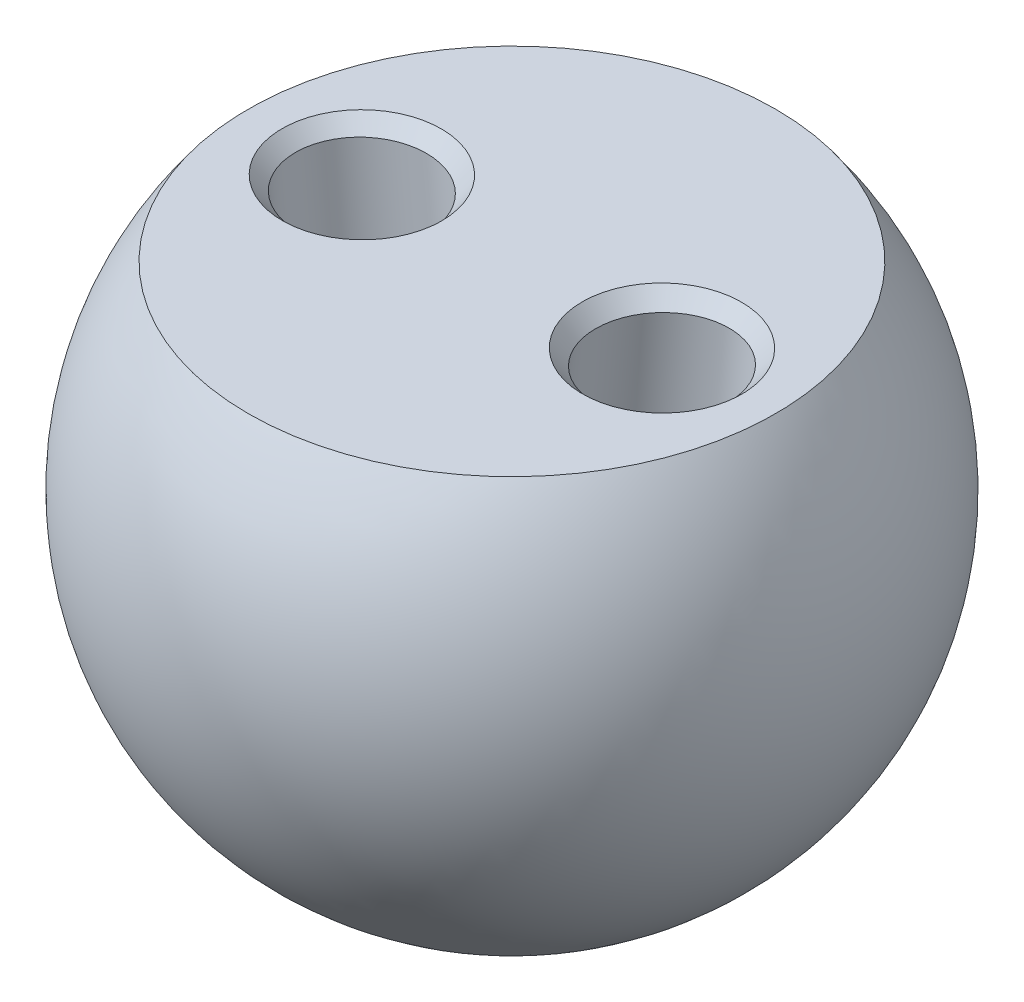
ISO-10303-21;
HEADER;
FILE_DESCRIPTION(('STEP AP214'),'2;1');
FILE_NAME('part.step','',(''),(''),'','','');
FILE_SCHEMA(('AUTOMOTIVE_DESIGN { 1 0 10303 214 1 1 1 1 }'));
ENDSEC;
DATA;
#1=APPLICATION_CONTEXT('core data for automotive mechanical design processes');
#2=APPLICATION_PROTOCOL_DEFINITION('international standard','automotive_design',2000,#1);
#3=PRODUCT_CONTEXT('',#1,'mechanical');
#4=PRODUCT('Part','Part','',(#3));
#5=PRODUCT_RELATED_PRODUCT_CATEGORY('part','',(#4));
#6=PRODUCT_DEFINITION_FORMATION('','',#4);
#7=PRODUCT_DEFINITION_CONTEXT('part definition',#1,'design');
#8=PRODUCT_DEFINITION('design','',#6,#7);
#9=PRODUCT_DEFINITION_SHAPE('','',#8);
#10=(LENGTH_UNIT() NAMED_UNIT(*) SI_UNIT(.MILLI.,.METRE.));
#11=(NAMED_UNIT(*) PLANE_ANGLE_UNIT() SI_UNIT($,.RADIAN.));
#12=(NAMED_UNIT(*) SI_UNIT($,.STERADIAN.) SOLID_ANGLE_UNIT());
#13=UNCERTAINTY_MEASURE_WITH_UNIT(LENGTH_MEASURE(1.E-05),#10,'distance_accuracy_value','');
#14=(GEOMETRIC_REPRESENTATION_CONTEXT(3) GLOBAL_UNCERTAINTY_ASSIGNED_CONTEXT((#13)) GLOBAL_UNIT_ASSIGNED_CONTEXT((#10,
#11,#12)) REPRESENTATION_CONTEXT('',''));
#15=CARTESIAN_POINT('',(0.,0.,0.));
#16=DIRECTION('',(0.,0.,1.));
#17=DIRECTION('',(1.,0.,0.));
#18=AXIS2_PLACEMENT_3D('',#15,#16,#17);
#19=CARTESIAN_POINT('',(0.,0.,0.));
#20=DIRECTION('',(0.,-1.,0.));
#21=DIRECTION('',(0.,0.,1.));
#22=AXIS2_PLACEMENT_3D('',#19,#20,#21);
#23=SPHERICAL_SURFACE('',#22,20.);
#24=CARTESIAN_POINT('',(0.,12.,0.));
#25=DIRECTION('',(0.,-1.,0.));
#26=DIRECTION('',(0.,0.,-1.));
#27=AXIS2_PLACEMENT_3D('',#24,#25,#26);
#28=CIRCLE('',#27,16.);
#29=CARTESIAN_POINT('',(0.,12.,-16.));
#30=VERTEX_POINT('',#29);
#31=EDGE_CURVE('E133',#30,#30,#28,.T.);
#32=ORIENTED_EDGE('',*,*,#31,.T.);
#33=EDGE_LOOP('',(#32));
#34=FACE_BOUND('',#33,.T.);
#35=ADVANCED_FACE('F37',(#34),#23,.T.);
#36=CARTESIAN_POINT('',(0.,12.,0.));
#37=DIRECTION('',(0.,1.,0.));
#38=DIRECTION('',(0.,0.,1.));
#39=AXIS2_PLACEMENT_3D('',#36,#37,#38);
#40=PLANE('',#39);
#41=CARTESIAN_POINT('',(-4.25758189983628,12.,0.));
#42=CARTESIAN_POINT('',(-4.25758189983628,12.,-0.315753843605591));
#43=CARTESIAN_POINT('',(-4.28882348174933,12.,-0.631494616984648));
#44=CARTESIAN_POINT('',(-4.41259433626494,12.,-1.25086806106186));
#45=CARTESIAN_POINT('',(-4.50511848553221,12.,-1.55447509359125));
#46=CARTESIAN_POINT('',(-4.74790375003477,12.,-2.13791212042559));
#47=CARTESIAN_POINT('',(-4.89815481548956,12.,-2.41771796411122));
#48=CARTESIAN_POINT('',(-5.25062438841793,12.,-2.94279741595592));
#49=CARTESIAN_POINT('',(-5.45282830587845,12.,-3.18804928914202));
#50=CARTESIAN_POINT('',(-5.90143697921028,12.,-3.63459265713107));
#51=CARTESIAN_POINT('',(-6.14782316552747,12.,-3.83586566786904));
#52=CARTESIAN_POINT('',(-6.67533115952786,12.,-4.18671254079643));
#53=CARTESIAN_POINT('',(-6.95643113173738,12.,-4.33627188015713));
#54=CARTESIAN_POINT('',(-7.54256661002643,12.,-4.57793940945538));
#55=CARTESIAN_POINT('',(-7.84757785383874,12.,-4.67003759589915));
#56=CARTESIAN_POINT('',(-8.46981595869514,12.,-4.79323863394788));
#57=CARTESIAN_POINT('',(-8.78701706306162,12.,-4.82433638581749));
#58=CARTESIAN_POINT('',(-9.42144553307251,12.,-4.8243363858175));
#59=CARTESIAN_POINT('',(-9.73864663743898,12.,-4.79323863394788));
#60=CARTESIAN_POINT('',(-10.3608847422954,12.,-4.67003759589916));
#61=CARTESIAN_POINT('',(-10.6658959861077,12.,-4.57793940945539));
#62=CARTESIAN_POINT('',(-11.2520314643967,12.,-4.33627188015713));
#63=CARTESIAN_POINT('',(-11.5331314366063,12.,-4.18671254079643));
#64=CARTESIAN_POINT('',(-12.0606394306066,12.,-3.83586566786904));
#65=CARTESIAN_POINT('',(-12.3070256169238,12.,-3.63459265713108));
#66=CARTESIAN_POINT('',(-12.7556342902557,12.,-3.18804928914203));
#67=CARTESIAN_POINT('',(-12.9578382077162,12.,-2.94279741595593));
#68=CARTESIAN_POINT('',(-13.3103077806446,12.,-2.41771796411122));
#69=CARTESIAN_POINT('',(-13.4605588460993,12.,-2.13791212042561));
#70=CARTESIAN_POINT('',(-13.7033441106019,12.,-1.55447509359127));
#71=CARTESIAN_POINT('',(-13.7958682598692,12.,-1.25086806106188));
#72=CARTESIAN_POINT('',(-13.9196391143848,12.,-0.631494616984648));
#73=CARTESIAN_POINT('',(-13.9508806962978,12.,-0.315753843605586));
#74=CARTESIAN_POINT('',(-13.9508806962978,12.,0.315753843605606));
#75=CARTESIAN_POINT('',(-13.9196391143848,12.,0.63149461698465));
#76=CARTESIAN_POINT('',(-13.7958682598692,12.,1.25086806106186));
#77=CARTESIAN_POINT('',(-13.7033441106019,12.,1.55447509359126));
#78=CARTESIAN_POINT('',(-13.4605588460993,12.,2.13791212042559));
#79=CARTESIAN_POINT('',(-13.3103077806446,12.,2.41771796411121));
#80=CARTESIAN_POINT('',(-12.9578382077162,12.,2.94279741595592));
#81=CARTESIAN_POINT('',(-12.7556342902557,12.,3.18804928914203));
#82=CARTESIAN_POINT('',(-12.3070256169238,12.,3.63459265713108));
#83=CARTESIAN_POINT('',(-12.0606394306067,12.,3.83586566786904));
#84=CARTESIAN_POINT('',(-11.5331314366063,12.,4.18671254079642));
#85=CARTESIAN_POINT('',(-11.2520314643967,12.,4.33627188015713));
#86=CARTESIAN_POINT('',(-10.6658959861077,12.,4.57793940945538));
#87=CARTESIAN_POINT('',(-10.3608847422954,12.,4.67003759589916));
#88=CARTESIAN_POINT('',(-9.73864663743899,12.,4.79323863394788));
#89=CARTESIAN_POINT('',(-9.4214455330725,12.,4.82433638581749));
#90=CARTESIAN_POINT('',(-8.78701706306162,12.,4.8243363858175));
#91=CARTESIAN_POINT('',(-8.46981595869514,12.,4.79323863394788));
#92=CARTESIAN_POINT('',(-7.84757785383875,12.,4.67003759589916));
#93=CARTESIAN_POINT('',(-7.54256661002643,12.,4.57793940945538));
#94=CARTESIAN_POINT('',(-6.95643113173738,12.,4.33627188015713));
#95=CARTESIAN_POINT('',(-6.67533115952787,12.,4.18671254079643));
#96=CARTESIAN_POINT('',(-6.14782316552747,12.,3.83586566786904));
#97=CARTESIAN_POINT('',(-5.90143697921028,12.,3.63459265713107));
#98=CARTESIAN_POINT('',(-5.45282830587846,12.,3.18804928914203));
#99=CARTESIAN_POINT('',(-5.25062438841793,12.,2.94279741595592));
#100=CARTESIAN_POINT('',(-4.89815481548956,12.,2.41771796411122));
#101=CARTESIAN_POINT('',(-4.74790375003477,12.,2.13791212042559));
#102=CARTESIAN_POINT('',(-4.50511848553222,12.,1.55447509359127));
#103=CARTESIAN_POINT('',(-4.41259433626494,12.,1.25086806106187));
#104=CARTESIAN_POINT('',(-4.28882348174933,12.,0.631494616984654));
#105=CARTESIAN_POINT('',(-4.25758189983628,12.,0.31575384360559));
#106=CARTESIAN_POINT('',(-4.25758189983628,12.,0.));
#107=B_SPLINE_CURVE_WITH_KNOTS('',3,(#41,#42,#43,#44,#45,#46,#47,#48,#49,#50,#51,#52,#53,#54,
#55,#56,#57,#58,#59,#60,#61,#62,#63,#64,#65,#66,#67,#68,#69,#70,#71,#72,#73,#74,#75,#76,#77,#78,
#79,#80,#81,#82,#83,#84,#85,#86,#87,#88,#89,#90,#91,#92,#93,#94,#95,#96,#97,#98,#99,#100,#101,
#102,#103,#104,#105,#106),.UNSPECIFIED.,.T.,.F.,(4,2,2,2,2,2,2,2,2,2,2,2,2,2,2,2,2,2,2,2,2,2,2,
2,2,2,2,2,2,2,2,2,4),(-6.28318530717959,-6.08683576633022,-5.89048622548086,-5.6941366846315,
-5.49778714378214,-5.30143760293278,-5.10508806208341,-4.90873852123405,-4.71238898038469,
-4.51603943953533,-4.31968989868597,-4.1233403578366,-3.92699081698724,-3.73064127613788,
-3.53429173528852,-3.33794219443916,-3.14159265358979,-2.94524311274043,-2.74889357189107,
-2.55254403104171,-2.35619449019234,-2.15984494934298,-1.96349540849362,-1.76714586764426,
-1.5707963267949,-1.37444678594553,-1.17809724509617,-0.98174770424681,-0.785398163397448,
-0.589048622548086,-0.392699081698724,-0.196349540849362,0.),.UNSPECIFIED.);
#108=CARTESIAN_POINT('',(-4.25758189983628,12.,0.));
#109=VERTEX_POINT('',#108);
#110=EDGE_CURVE('E55',#109,#109,#107,.F.);
#111=ORIENTED_EDGE('',*,*,#110,.T.);
#112=EDGE_LOOP('',(#111));
#113=FACE_BOUND('',#112,.T.);
#114=CARTESIAN_POINT('',(4.25758189983626,12.,0.));
#115=CARTESIAN_POINT('',(4.25758189983626,12.,0.315753843605592));
#116=CARTESIAN_POINT('',(4.28882348174932,12.,0.63149461698465));
#117=CARTESIAN_POINT('',(4.41259433626492,12.,1.25086806106187));
#118=CARTESIAN_POINT('',(4.5051184855322,12.,1.55447509359126));
#119=CARTESIAN_POINT('',(4.74790375003476,12.,2.1379121204256));
#120=CARTESIAN_POINT('',(4.89815481548955,12.,2.41771796411122));
#121=CARTESIAN_POINT('',(5.25062438841792,12.,2.94279741595593));
#122=CARTESIAN_POINT('',(5.45282830587844,12.,3.18804928914202));
#123=CARTESIAN_POINT('',(5.90143697921027,12.,3.63459265713108));
#124=CARTESIAN_POINT('',(6.14782316552746,12.,3.83586566786905));
#125=CARTESIAN_POINT('',(6.67533115952786,12.,4.18671254079644));
#126=CARTESIAN_POINT('',(6.95643113173737,12.,4.33627188015714));
#127=CARTESIAN_POINT('',(7.54256661002642,12.,4.5779394094554));
#128=CARTESIAN_POINT('',(7.84757785383873,12.,4.67003759589917));
#129=CARTESIAN_POINT('',(8.46981595869513,12.,4.79323863394789));
#130=CARTESIAN_POINT('',(8.78701706306162,12.,4.82433638581751));
#131=CARTESIAN_POINT('',(9.42144553307251,12.,4.82433638581751));
#132=CARTESIAN_POINT('',(9.73864663743898,12.,4.79323863394789));
#133=CARTESIAN_POINT('',(10.3608847422954,12.,4.67003759589917));
#134=CARTESIAN_POINT('',(10.6658959861077,12.,4.5779394094554));
#135=CARTESIAN_POINT('',(11.2520314643967,12.,4.33627188015714));
#136=CARTESIAN_POINT('',(11.5331314366063,12.,4.18671254079644));
#137=CARTESIAN_POINT('',(12.0606394306067,12.,3.83586566786905));
#138=CARTESIAN_POINT('',(12.3070256169238,12.,3.63459265713109));
#139=CARTESIAN_POINT('',(12.7556342902557,12.,3.18804928914204));
#140=CARTESIAN_POINT('',(12.9578382077162,12.,2.94279741595594));
#141=CARTESIAN_POINT('',(13.3103077806446,12.,2.41771796411122));
#142=CARTESIAN_POINT('',(13.4605588460993,12.,2.13791212042561));
#143=CARTESIAN_POINT('',(13.7033441106019,12.,1.55447509359127));
#144=CARTESIAN_POINT('',(13.7958682598692,12.,1.25086806106188));
#145=CARTESIAN_POINT('',(13.9196391143848,12.,0.631494616984649));
#146=CARTESIAN_POINT('',(13.9508806962979,12.,0.315753843605586));
#147=CARTESIAN_POINT('',(13.9508806962979,12.,-0.315753843605607));
#148=CARTESIAN_POINT('',(13.9196391143848,12.,-0.631494616984651));
#149=CARTESIAN_POINT('',(13.7958682598692,12.,-1.25086806106186));
#150=CARTESIAN_POINT('',(13.7033441106019,12.,-1.55447509359126));
#151=CARTESIAN_POINT('',(13.4605588460994,12.,-2.1379121204256));
#152=CARTESIAN_POINT('',(13.3103077806446,12.,-2.41771796411122));
#153=CARTESIAN_POINT('',(12.9578382077162,12.,-2.94279741595593));
#154=CARTESIAN_POINT('',(12.7556342902557,12.,-3.18804928914204));
#155=CARTESIAN_POINT('',(12.3070256169238,12.,-3.63459265713109));
#156=CARTESIAN_POINT('',(12.0606394306067,12.,-3.83586566786905));
#157=CARTESIAN_POINT('',(11.5331314366063,12.,-4.18671254079643));
#158=CARTESIAN_POINT('',(11.2520314643968,12.,-4.33627188015714));
#159=CARTESIAN_POINT('',(10.6658959861077,12.,-4.5779394094554));
#160=CARTESIAN_POINT('',(10.3608847422954,12.,-4.67003759589917));
#161=CARTESIAN_POINT('',(9.73864663743898,12.,-4.79323863394789));
#162=CARTESIAN_POINT('',(9.4214455330725,12.,-4.82433638581751));
#163=CARTESIAN_POINT('',(8.78701706306161,12.,-4.82433638581751));
#164=CARTESIAN_POINT('',(8.46981595869514,12.,-4.79323863394789));
#165=CARTESIAN_POINT('',(7.84757785383875,12.,-4.67003759589917));
#166=CARTESIAN_POINT('',(7.54256661002642,12.,-4.5779394094554));
#167=CARTESIAN_POINT('',(6.95643113173737,12.,-4.33627188015714));
#168=CARTESIAN_POINT('',(6.67533115952786,12.,-4.18671254079644));
#169=CARTESIAN_POINT('',(6.14782316552746,12.,-3.83586566786905));
#170=CARTESIAN_POINT('',(5.90143697921027,12.,-3.63459265713108));
#171=CARTESIAN_POINT('',(5.45282830587845,12.,-3.18804928914204));
#172=CARTESIAN_POINT('',(5.25062438841792,12.,-2.94279741595593));
#173=CARTESIAN_POINT('',(4.89815481548955,12.,-2.41771796411123));
#174=CARTESIAN_POINT('',(4.74790375003476,12.,-2.1379121204256));
#175=CARTESIAN_POINT('',(4.5051184855322,12.,-1.55447509359127));
#176=CARTESIAN_POINT('',(4.41259433626492,12.,-1.25086806106187));
#177=CARTESIAN_POINT('',(4.28882348174932,12.,-0.631494616984656));
#178=CARTESIAN_POINT('',(4.25758189983626,12.,-0.315753843605591));
#179=CARTESIAN_POINT('',(4.25758189983626,12.,0.));
#180=B_SPLINE_CURVE_WITH_KNOTS('',3,(#114,#115,#116,#117,#118,#119,#120,#121,#122,#123,#124,
#125,#126,#127,#128,#129,#130,#131,#132,#133,#134,#135,#136,#137,#138,#139,#140,#141,#142,#143,
#144,#145,#146,#147,#148,#149,#150,#151,#152,#153,#154,#155,#156,#157,#158,#159,#160,#161,#162,
#163,#164,#165,#166,#167,#168,#169,#170,#171,#172,#173,#174,#175,#176,#177,#178,#179),
.UNSPECIFIED.,.T.,.F.,(4,2,2,2,2,2,2,2,2,2,2,2,2,2,2,2,2,2,2,2,2,2,2,2,2,2,2,2,2,2,2,2,4),
(-6.28318530717959,-6.08683576633022,-5.89048622548086,-5.6941366846315,-5.49778714378214,
-5.30143760293278,-5.10508806208341,-4.90873852123405,-4.71238898038469,-4.51603943953533,
-4.31968989868597,-4.1233403578366,-3.92699081698724,-3.73064127613788,-3.53429173528852,
-3.33794219443916,-3.14159265358979,-2.94524311274043,-2.74889357189107,-2.55254403104171,
-2.35619449019234,-2.15984494934298,-1.96349540849362,-1.76714586764426,-1.5707963267949,
-1.37444678594553,-1.17809724509617,-0.98174770424681,-0.785398163397448,-0.589048622548086,
-0.392699081698724,-0.196349540849362,0.),.UNSPECIFIED.);
#181=CARTESIAN_POINT('',(4.25758189983626,12.,0.));
#182=VERTEX_POINT('',#181);
#183=EDGE_CURVE('E60',#182,#182,#180,.F.);
#184=ORIENTED_EDGE('',*,*,#183,.T.);
#185=EDGE_LOOP('',(#184));
#186=FACE_BOUND('',#185,.T.);
#187=ORIENTED_EDGE('',*,*,#31,.F.);
#188=EDGE_LOOP('',(#187));
#189=FACE_BOUND('',#188,.T.);
#190=ADVANCED_FACE('F83',(#113,#186,#189),#40,.T.);
#191=CARTESIAN_POINT('',(9.29175172472006,13.0310870342896,0.));
#192=DIRECTION('',(-0.0958457525202242,-0.995396198367179,0.));
#193=DIRECTION('',(0.995396198367179,-0.0958457525202242,0.));
#194=AXIS2_PLACEMENT_3D('',#191,#192,#193);
#195=CYLINDRICAL_SURFACE('',#194,4.);
#196=CARTESIAN_POINT('',(5.07812320445475,11.0046038016328,0.));
#197=CARTESIAN_POINT('',(5.07812320445475,11.0046038016328,-0.261800851646131));
#198=CARTESIAN_POINT('',(5.104075563592,11.0051130958595,-0.523590866373562));
#199=CARTESIAN_POINT('',(5.20689192148759,11.0071307843946,-1.03713170975547));
#200=CARTESIAN_POINT('',(5.28375166429261,11.0086390951833,-1.28886128103266));
#201=CARTESIAN_POINT('',(5.48543320510861,11.0125969336146,-1.77260617788805));
#202=CARTESIAN_POINT('',(5.61024665477064,11.0150462974276,-2.00460147946387));
#203=CARTESIAN_POINT('',(5.90304286999555,11.0207921882437,-2.43996038469295));
#204=CARTESIAN_POINT('',(6.07101351564255,11.0240884774033,-2.64330596723248));
#205=CARTESIAN_POINT('',(6.44367241092495,11.0314016092425,-3.0135482822599));
#206=CARTESIAN_POINT('',(6.64834523484573,11.0354181492049,-3.18042968906256));
#207=CARTESIAN_POINT('',(7.08654573782779,11.0440174825117,-3.4713272093578));
#208=CARTESIAN_POINT('',(7.32005527818196,11.0485999198987,-3.59533128154631));
#209=CARTESIAN_POINT('',(7.8069575892793,11.0581549871168,-3.79570497854398));
#210=CARTESIAN_POINT('',(8.06033020538447,11.0631272214294,-3.87206630916417));
#211=CARTESIAN_POINT('',(8.57722294184052,11.0732708266842,-3.97421593406167));
#212=CARTESIAN_POINT('',(8.8407216661513,11.0784417777462,-4.));
#213=CARTESIAN_POINT('',(9.3677409299828,11.0887841079763,-4.));
#214=CARTESIAN_POINT('',(9.6312396542936,11.0939550590384,-3.97421593406167));
#215=CARTESIAN_POINT('',(10.1481323907497,11.1040986642931,-3.87206630916417));
#216=CARTESIAN_POINT('',(10.4015050068548,11.1090708986057,-3.79570497854398));
#217=CARTESIAN_POINT('',(10.8884073179522,11.1186259658239,-3.59533128154631));
#218=CARTESIAN_POINT('',(11.1219168583063,11.1232084032108,-3.4713272093578));
#219=CARTESIAN_POINT('',(11.5601173612884,11.1318077365177,-3.18042968906256));
#220=CARTESIAN_POINT('',(11.7647901852092,11.1358242764801,-3.0135482822599));
#221=CARTESIAN_POINT('',(12.1374490804916,11.1431374083193,-2.64330596723248));
#222=CARTESIAN_POINT('',(12.3054197261386,11.1464336974788,-2.43996038469296));
#223=CARTESIAN_POINT('',(12.5982159413635,11.1521795882949,-2.00460147946386));
#224=CARTESIAN_POINT('',(12.7230293910255,11.1546289521079,-1.77260617788805));
#225=CARTESIAN_POINT('',(12.9247109318415,11.1585867905392,-1.28886128103266));
#226=CARTESIAN_POINT('',(13.0015706746465,11.1600951013279,-1.03713170975546));
#227=CARTESIAN_POINT('',(13.1043870325421,11.162112789863,-0.52359086637356));
#228=CARTESIAN_POINT('',(13.1303393916794,11.1626220840898,-0.261800851646146));
#229=CARTESIAN_POINT('',(13.1303393916794,11.1626220840898,0.26180085164613));
#230=CARTESIAN_POINT('',(13.1043870325421,11.162112789863,0.523590866373558));
#231=CARTESIAN_POINT('',(13.0015706746465,11.1600951013279,1.03713170975547));
#232=CARTESIAN_POINT('',(12.9247109318415,11.1585867905392,1.28886128103267));
#233=CARTESIAN_POINT('',(12.7230293910255,11.1546289521079,1.77260617788806));
#234=CARTESIAN_POINT('',(12.5982159413635,11.1521795882949,2.00460147946387));
#235=CARTESIAN_POINT('',(12.3054197261386,11.1464336974788,2.43996038469296));
#236=CARTESIAN_POINT('',(12.1374490804916,11.1431374083193,2.64330596723248));
#237=CARTESIAN_POINT('',(11.7647901852091,11.1358242764801,3.01354828225991));
#238=CARTESIAN_POINT('',(11.5601173612884,11.1318077365177,3.18042968906256));
#239=CARTESIAN_POINT('',(11.1219168583063,11.1232084032108,3.4713272093578));
#240=CARTESIAN_POINT('',(10.8884073179522,11.1186259658239,3.59533128154632));
#241=CARTESIAN_POINT('',(10.4015050068548,11.1090708986057,3.79570497854398));
#242=CARTESIAN_POINT('',(10.1481323907496,11.1040986642931,3.87206630916417));
#243=CARTESIAN_POINT('',(9.6312396542936,11.0939550590384,3.97421593406167));
#244=CARTESIAN_POINT('',(9.36774092998282,11.0887841079763,4.));
#245=CARTESIAN_POINT('',(8.84072166615131,11.0784417777462,4.));
#246=CARTESIAN_POINT('',(8.57722294184052,11.0732708266842,3.97421593406167));
#247=CARTESIAN_POINT('',(8.06033020538446,11.0631272214294,3.87206630916417));
#248=CARTESIAN_POINT('',(7.8069575892793,11.0581549871168,3.79570497854398));
#249=CARTESIAN_POINT('',(7.32005527818195,11.0485999198987,3.59533128154631));
#250=CARTESIAN_POINT('',(7.08654573782779,11.0440174825117,3.4713272093578));
#251=CARTESIAN_POINT('',(6.64834523484573,11.0354181492049,3.18042968906256));
#252=CARTESIAN_POINT('',(6.44367241092496,11.0314016092425,3.0135482822599));
#253=CARTESIAN_POINT('',(6.07101351564253,11.0240884774033,2.64330596723247));
#254=CARTESIAN_POINT('',(5.90304286999555,11.0207921882437,2.43996038469295));
#255=CARTESIAN_POINT('',(5.61024665477064,11.0150462974276,2.00460147946387));
#256=CARTESIAN_POINT('',(5.48543320510861,11.0125969336146,1.77260617788805));
#257=CARTESIAN_POINT('',(5.28375166429261,11.0086390951833,1.28886128103265));
#258=CARTESIAN_POINT('',(5.2068919214876,11.0071307843946,1.03713170975546));
#259=CARTESIAN_POINT('',(5.10407556359199,11.0051130958595,0.523590866373559));
#260=CARTESIAN_POINT('',(5.07812320445475,11.0046038016328,0.261800851646132));
#261=CARTESIAN_POINT('',(5.07812320445475,11.0046038016328,0.));
#262=B_SPLINE_CURVE_WITH_KNOTS('',3,(#196,#197,#198,#199,#200,#201,#202,#203,#204,#205,#206,
#207,#208,#209,#210,#211,#212,#213,#214,#215,#216,#217,#218,#219,#220,#221,#222,#223,#224,#225,
#226,#227,#228,#229,#230,#231,#232,#233,#234,#235,#236,#237,#238,#239,#240,#241,#242,#243,#244,
#245,#246,#247,#248,#249,#250,#251,#252,#253,#254,#255,#256,#257,#258,#259,#260,#261),
.UNSPECIFIED.,.T.,.F.,(4,2,2,2,2,2,2,2,2,2,2,2,2,2,2,2,2,2,2,2,2,2,2,2,2,2,2,2,2,2,2,2,4),
(-6.28318530717959,-6.08683576633022,-5.89048622548086,-5.6941366846315,-5.49778714378214,
-5.30143760293278,-5.10508806208341,-4.90873852123405,-4.71238898038469,-4.51603943953533,
-4.31968989868597,-4.1233403578366,-3.92699081698724,-3.73064127613788,-3.53429173528852,
-3.33794219443916,-3.14159265358979,-2.94524311274043,-2.74889357189107,-2.55254403104171,
-2.35619449019234,-2.15984494934298,-1.96349540849362,-1.76714586764426,-1.5707963267949,
-1.37444678594553,-1.17809724509617,-0.981747704246811,-0.785398163397448,-0.589048622548086,
-0.392699081698725,-0.196349540849362,0.),.UNSPECIFIED.);
#263=CARTESIAN_POINT('',(5.07812320445475,11.0046038016328,0.));
#264=VERTEX_POINT('',#263);
#265=EDGE_CURVE('E10',#264,#264,#262,.F.);
#266=ORIENTED_EDGE('',*,*,#265,.T.);
#267=EDGE_LOOP('',(#266));
#268=FACE_BOUND('',#267,.T.);
#269=CARTESIAN_POINT('',(7.9631695869392,-0.766766020143368,0.));
#270=DIRECTION('',(0.0958457525202243,0.995396198367179,0.));
#271=DIRECTION('',(-0.995396198367179,0.0958457525202243,0.));
#272=AXIS2_PLACEMENT_3D('',#269,#270,#271);
#273=CIRCLE('',#272,4.);
#274=CARTESIAN_POINT('',(3.98158479347049,-0.383383010062471,0.));
#275=VERTEX_POINT('',#274);
#276=EDGE_CURVE('E75',#275,#275,#273,.F.);
#277=ORIENTED_EDGE('',*,*,#276,.T.);
#278=EDGE_LOOP('',(#277));
#279=FACE_BOUND('',#278,.T.);
#280=ADVANCED_FACE('F93',(#268,#279),#195,.F.);
#281=CARTESIAN_POINT('',(7.00471206173519,-10.7207280038336,0.));
#282=DIRECTION('',(0.0958457525202242,0.995396198367179,0.));
#283=DIRECTION('',(-0.995396198367179,0.0958457525202242,0.));
#284=AXIS2_PLACEMENT_3D('',#281,#282,#283);
#285=PLANE('',#284);
#286=CARTESIAN_POINT('',(7.00471206173519,-10.7207280038336,0.));
#287=DIRECTION('',(0.0958457525202242,0.995396198367179,0.));
#288=DIRECTION('',(-0.995396198367179,0.0958457525202242,0.));
#289=AXIS2_PLACEMENT_3D('',#286,#287,#288);
#290=CIRCLE('',#289,3.82544935071748);
#291=CARTESIAN_POINT('',(3.19687432098481,-10.3540749320861,0.));
#292=VERTEX_POINT('',#291);
#293=EDGE_CURVE('E135',#292,#292,#290,.T.);
#294=ORIENTED_EDGE('',*,*,#293,.T.);
#295=EDGE_LOOP('',(#294));
#296=FACE_BOUND('',#295,.T.);
#297=ADVANCED_FACE('F120',(#296),#285,.T.);
#298=CARTESIAN_POINT('',(-9.29175172472006,13.0310870342896,0.));
#299=DIRECTION('',(0.0958457525202242,-0.995396198367179,0.));
#300=DIRECTION('',(0.995396198367179,0.0958457525202242,0.));
#301=AXIS2_PLACEMENT_3D('',#298,#299,#300);
#302=CYLINDRICAL_SURFACE('',#301,4.);
#303=CARTESIAN_POINT('',(-5.07812320445475,11.0046038016328,0.));
#304=CARTESIAN_POINT('',(-5.07812320445475,11.0046038016328,0.261800851646133));
#305=CARTESIAN_POINT('',(-5.104075563592,11.0051130958595,0.523590866373563));
#306=CARTESIAN_POINT('',(-5.2068919214876,11.0071307843947,1.03713170975547));
#307=CARTESIAN_POINT('',(-5.28375166429261,11.0086390951834,1.28886128103266));
#308=CARTESIAN_POINT('',(-5.48543320510861,11.0125969336147,1.77260617788805));
#309=CARTESIAN_POINT('',(-5.61024665477064,11.0150462974276,2.00460147946387));
#310=CARTESIAN_POINT('',(-5.90304286999555,11.0207921882438,2.43996038469295));
#311=CARTESIAN_POINT('',(-6.07101351564255,11.0240884774033,2.64330596723248));
#312=CARTESIAN_POINT('',(-6.44367241092495,11.0314016092425,3.01354828225989));
#313=CARTESIAN_POINT('',(-6.64834523484573,11.0354181492049,3.18042968906256));
#314=CARTESIAN_POINT('',(-7.0865457378278,11.0440174825117,3.47132720935781));
#315=CARTESIAN_POINT('',(-7.32005527818196,11.0485999198987,3.59533128154631));
#316=CARTESIAN_POINT('',(-7.80695758927931,11.0581549871168,3.79570497854398));
#317=CARTESIAN_POINT('',(-8.06033020538447,11.0631272214294,3.87206630916417));
#318=CARTESIAN_POINT('',(-8.57722294184053,11.0732708266842,3.97421593406167));
#319=CARTESIAN_POINT('',(-8.8407216661513,11.0784417777462,4.));
#320=CARTESIAN_POINT('',(-9.36774092998281,11.0887841079763,4.));
#321=CARTESIAN_POINT('',(-9.6312396542936,11.0939550590384,3.97421593406167));
#322=CARTESIAN_POINT('',(-10.1481323907497,11.1040986642932,3.87206630916417));
#323=CARTESIAN_POINT('',(-10.4015050068548,11.1090708986058,3.79570497854398));
#324=CARTESIAN_POINT('',(-10.8884073179522,11.1186259658239,3.59533128154631));
#325=CARTESIAN_POINT('',(-11.1219168583063,11.1232084032108,3.4713272093578));
#326=CARTESIAN_POINT('',(-11.5601173612884,11.1318077365177,3.18042968906256));
#327=CARTESIAN_POINT('',(-11.7647901852092,11.1358242764801,3.0135482822599));
#328=CARTESIAN_POINT('',(-12.1374490804916,11.1431374083193,2.64330596723248));
#329=CARTESIAN_POINT('',(-12.3054197261386,11.1464336974788,2.43996038469295));
#330=CARTESIAN_POINT('',(-12.5982159413635,11.152179588295,2.00460147946386));
#331=CARTESIAN_POINT('',(-12.7230293910255,11.1546289521079,1.77260617788805));
#332=CARTESIAN_POINT('',(-12.9247109318415,11.1585867905392,1.28886128103265));
#333=CARTESIAN_POINT('',(-13.0015706746465,11.1600951013279,1.03713170975546));
#334=CARTESIAN_POINT('',(-13.1043870325421,11.162112789863,0.52359086637356));
#335=CARTESIAN_POINT('',(-13.1303393916794,11.1626220840898,0.261800851646142));
#336=CARTESIAN_POINT('',(-13.1303393916794,11.1626220840898,-0.261800851646127));
#337=CARTESIAN_POINT('',(-13.1043870325421,11.162112789863,-0.523590866373557));
#338=CARTESIAN_POINT('',(-13.0015706746465,11.1600951013279,-1.03713170975547));
#339=CARTESIAN_POINT('',(-12.9247109318415,11.1585867905392,-1.28886128103266));
#340=CARTESIAN_POINT('',(-12.7230293910255,11.1546289521079,-1.77260617788806));
#341=CARTESIAN_POINT('',(-12.5982159413635,11.152179588295,-2.00460147946386));
#342=CARTESIAN_POINT('',(-12.3054197261386,11.1464336974788,-2.43996038469296));
#343=CARTESIAN_POINT('',(-12.1374490804916,11.1431374083193,-2.64330596723248));
#344=CARTESIAN_POINT('',(-11.7647901852092,11.1358242764801,-3.01354828225991));
#345=CARTESIAN_POINT('',(-11.5601173612884,11.1318077365177,-3.18042968906256));
#346=CARTESIAN_POINT('',(-11.1219168583063,11.1232084032108,-3.4713272093578));
#347=CARTESIAN_POINT('',(-10.8884073179522,11.1186259658239,-3.59533128154631));
#348=CARTESIAN_POINT('',(-10.4015050068548,11.1090708986058,-3.79570497854398));
#349=CARTESIAN_POINT('',(-10.1481323907496,11.1040986642932,-3.87206630916417));
#350=CARTESIAN_POINT('',(-9.6312396542936,11.0939550590384,-3.97421593406167));
#351=CARTESIAN_POINT('',(-9.36774092998282,11.0887841079763,-4.));
#352=CARTESIAN_POINT('',(-8.84072166615131,11.0784417777462,-4.));
#353=CARTESIAN_POINT('',(-8.57722294184052,11.0732708266842,-3.97421593406167));
#354=CARTESIAN_POINT('',(-8.06033020538446,11.0631272214294,-3.87206630916417));
#355=CARTESIAN_POINT('',(-7.80695758927931,11.0581549871168,-3.79570497854398));
#356=CARTESIAN_POINT('',(-7.32005527818195,11.0485999198987,-3.59533128154631));
#357=CARTESIAN_POINT('',(-7.08654573782779,11.0440174825117,-3.4713272093578));
#358=CARTESIAN_POINT('',(-6.64834523484573,11.0354181492049,-3.18042968906256));
#359=CARTESIAN_POINT('',(-6.44367241092495,11.0314016092425,-3.01354828225989));
#360=CARTESIAN_POINT('',(-6.07101351564254,11.0240884774033,-2.64330596723247));
#361=CARTESIAN_POINT('',(-5.90304286999555,11.0207921882438,-2.43996038469295));
#362=CARTESIAN_POINT('',(-5.61024665477064,11.0150462974276,-2.00460147946387));
#363=CARTESIAN_POINT('',(-5.48543320510861,11.0125969336147,-1.77260617788805));
#364=CARTESIAN_POINT('',(-5.28375166429261,11.0086390951834,-1.28886128103265));
#365=CARTESIAN_POINT('',(-5.2068919214876,11.0071307843947,-1.03713170975546));
#366=CARTESIAN_POINT('',(-5.104075563592,11.0051130958595,-0.523590866373559));
#367=CARTESIAN_POINT('',(-5.07812320445475,11.0046038016328,-0.261800851646134));
#368=CARTESIAN_POINT('',(-5.07812320445475,11.0046038016328,0.));
#369=B_SPLINE_CURVE_WITH_KNOTS('',3,(#303,#304,#305,#306,#307,#308,#309,#310,#311,#312,#313,
#314,#315,#316,#317,#318,#319,#320,#321,#322,#323,#324,#325,#326,#327,#328,#329,#330,#331,#332,
#333,#334,#335,#336,#337,#338,#339,#340,#341,#342,#343,#344,#345,#346,#347,#348,#349,#350,#351,
#352,#353,#354,#355,#356,#357,#358,#359,#360,#361,#362,#363,#364,#365,#366,#367,#368),
.UNSPECIFIED.,.T.,.F.,(4,2,2,2,2,2,2,2,2,2,2,2,2,2,2,2,2,2,2,2,2,2,2,2,2,2,2,2,2,2,2,2,4),
(-6.28318530717959,-6.08683576633022,-5.89048622548086,-5.6941366846315,-5.49778714378214,
-5.30143760293278,-5.10508806208341,-4.90873852123405,-4.71238898038469,-4.51603943953533,
-4.31968989868597,-4.1233403578366,-3.92699081698724,-3.73064127613788,-3.53429173528852,
-3.33794219443916,-3.14159265358979,-2.94524311274043,-2.74889357189107,-2.55254403104171,
-2.35619449019234,-2.15984494934298,-1.96349540849362,-1.76714586764426,-1.5707963267949,
-1.37444678594553,-1.17809724509617,-0.981747704246811,-0.785398163397448,-0.589048622548086,
-0.392699081698725,-0.196349540849362,0.),.UNSPECIFIED.);
#370=CARTESIAN_POINT('',(-5.07812320445475,11.0046038016328,0.));
#371=VERTEX_POINT('',#370);
#372=EDGE_CURVE('E50',#371,#371,#369,.F.);
#373=ORIENTED_EDGE('',*,*,#372,.T.);
#374=EDGE_LOOP('',(#373));
#375=FACE_BOUND('',#374,.T.);
#376=CARTESIAN_POINT('',(-7.96316958693607,-0.766766020175866,0.));
#377=DIRECTION('',(-0.0958457525202242,0.995396198367179,0.));
#378=DIRECTION('',(-0.995396198367179,-0.0958457525202242,0.));
#379=AXIS2_PLACEMENT_3D('',#376,#377,#378);
#380=CIRCLE('',#379,4.);
#381=CARTESIAN_POINT('',(-11.9447543804048,-1.15014903025676,0.));
#382=VERTEX_POINT('',#381);
#383=EDGE_CURVE('E65',#382,#382,#380,.F.);
#384=ORIENTED_EDGE('',*,*,#383,.T.);
#385=EDGE_LOOP('',(#384));
#386=FACE_BOUND('',#385,.T.);
#387=ADVANCED_FACE('F110',(#375,#386),#302,.F.);
#388=CARTESIAN_POINT('',(-7.00471206173519,-10.7207280038336,0.));
#389=DIRECTION('',(-0.0958457525202242,0.995396198367179,0.));
#390=DIRECTION('',(-0.995396198367179,-0.0958457525202242,0.));
#391=AXIS2_PLACEMENT_3D('',#388,#389,#390);
#392=PLANE('',#391);
#393=CARTESIAN_POINT('',(-7.00471206173519,-10.7207280038336,0.));
#394=DIRECTION('',(-0.0958457525202242,0.995396198367179,0.));
#395=DIRECTION('',(-0.995396198367179,-0.0958457525202242,0.));
#396=AXIS2_PLACEMENT_3D('',#393,#394,#395);
#397=CIRCLE('',#396,3.82544935071804);
#398=CARTESIAN_POINT('',(-10.8125498024861,-11.0873810755812,0.));
#399=VERTEX_POINT('',#398);
#400=EDGE_CURVE('E70',#399,#399,#397,.T.);
#401=ORIENTED_EDGE('',*,*,#400,.T.);
#402=EDGE_LOOP('',(#401));
#403=FACE_BOUND('',#402,.T.);
#404=ADVANCED_FACE('F119',(#403),#392,.T.);
#405=CARTESIAN_POINT('',(7.00471206173519,-10.7207280038336,0.));
#406=DIRECTION('',(0.0958457525202243,0.995396198367179,0.));
#407=DIRECTION('',(-0.995396198367179,0.0958457525202243,0.));
#408=AXIS2_PLACEMENT_3D('',#405,#406,#407);
#409=CONICAL_SURFACE('',#408,3.82544935071748,0.017453292519945);
#410=ORIENTED_EDGE('',*,*,#276,.F.);
#411=EDGE_LOOP('',(#410));
#412=FACE_BOUND('',#411,.T.);
#413=ORIENTED_EDGE('',*,*,#293,.F.);
#414=EDGE_LOOP('',(#413));
#415=FACE_BOUND('',#414,.T.);
#416=ADVANCED_FACE('F142',(#412,#415),#409,.F.);
#417=CARTESIAN_POINT('',(-7.00471206173519,-10.7207280038336,0.));
#418=DIRECTION('',(-0.0958457525202242,0.995396198367179,0.));
#419=DIRECTION('',(-0.995396198367179,-0.0958457525202242,0.));
#420=AXIS2_PLACEMENT_3D('',#417,#418,#419);
#421=CONICAL_SURFACE('',#420,3.82544935071804,0.0174532925199468);
#422=ORIENTED_EDGE('',*,*,#383,.F.);
#423=EDGE_LOOP('',(#422));
#424=FACE_BOUND('',#423,.T.);
#425=ORIENTED_EDGE('',*,*,#400,.F.);
#426=EDGE_LOOP('',(#425));
#427=FACE_BOUND('',#426,.T.);
#428=ADVANCED_FACE('F145',(#424,#427),#421,.F.);
#429=CARTESIAN_POINT('',(-5.07812320445475,11.0046038016328,0.));
#430=CARTESIAN_POINT('',(-5.07812320445475,11.0046038016328,-0.261800851646134));
#431=CARTESIAN_POINT('',(-5.104075563592,11.0051130958595,-0.523590866373559));
#432=CARTESIAN_POINT('',(-5.2068919214876,11.0071307843947,-1.03713170975546));
#433=CARTESIAN_POINT('',(-5.28375166429261,11.0086390951834,-1.28886128103265));
#434=CARTESIAN_POINT('',(-5.48543320510861,11.0125969336147,-1.77260617788805));
#435=CARTESIAN_POINT('',(-5.61024665477064,11.0150462974276,-2.00460147946387));
#436=CARTESIAN_POINT('',(-5.90304286999555,11.0207921882438,-2.43996038469295));
#437=CARTESIAN_POINT('',(-6.07101351564254,11.0240884774033,-2.64330596723247));
#438=CARTESIAN_POINT('',(-6.44367241092495,11.0314016092425,-3.01354828225989));
#439=CARTESIAN_POINT('',(-6.64834523484573,11.0354181492049,-3.18042968906256));
#440=CARTESIAN_POINT('',(-7.08654573782779,11.0440174825117,-3.4713272093578));
#441=CARTESIAN_POINT('',(-7.32005527818195,11.0485999198987,-3.59533128154631));
#442=CARTESIAN_POINT('',(-7.80695758927931,11.0581549871168,-3.79570497854398));
#443=CARTESIAN_POINT('',(-8.06033020538446,11.0631272214294,-3.87206630916417));
#444=CARTESIAN_POINT('',(-8.57722294184052,11.0732708266842,-3.97421593406167));
#445=CARTESIAN_POINT('',(-8.84072166615131,11.0784417777462,-4.));
#446=CARTESIAN_POINT('',(-9.36774092998282,11.0887841079763,-4.));
#447=CARTESIAN_POINT('',(-9.6312396542936,11.0939550590384,-3.97421593406167));
#448=CARTESIAN_POINT('',(-10.1481323907496,11.1040986642932,-3.87206630916417));
#449=CARTESIAN_POINT('',(-10.4015050068548,11.1090708986058,-3.79570497854398));
#450=CARTESIAN_POINT('',(-10.8884073179522,11.1186259658239,-3.59533128154631));
#451=CARTESIAN_POINT('',(-11.1219168583063,11.1232084032108,-3.4713272093578));
#452=CARTESIAN_POINT('',(-11.5601173612884,11.1318077365177,-3.18042968906256));
#453=CARTESIAN_POINT('',(-11.7647901852092,11.1358242764801,-3.01354828225991));
#454=CARTESIAN_POINT('',(-12.1374490804916,11.1431374083193,-2.64330596723248));
#455=CARTESIAN_POINT('',(-12.3054197261386,11.1464336974788,-2.43996038469296));
#456=CARTESIAN_POINT('',(-12.5982159413635,11.152179588295,-2.00460147946386));
#457=CARTESIAN_POINT('',(-12.7230293910255,11.1546289521079,-1.77260617788806));
#458=CARTESIAN_POINT('',(-12.9247109318415,11.1585867905392,-1.28886128103266));
#459=CARTESIAN_POINT('',(-13.0015706746465,11.1600951013279,-1.03713170975547));
#460=CARTESIAN_POINT('',(-13.1043870325421,11.162112789863,-0.523590866373557));
#461=CARTESIAN_POINT('',(-13.1303393916794,11.1626220840898,-0.261800851646127));
#462=CARTESIAN_POINT('',(-13.1303393916794,11.1626220840898,0.261800851646142));
#463=CARTESIAN_POINT('',(-13.1043870325421,11.162112789863,0.52359086637356));
#464=CARTESIAN_POINT('',(-13.0015706746465,11.1600951013279,1.03713170975546));
#465=CARTESIAN_POINT('',(-12.9247109318415,11.1585867905392,1.28886128103265));
#466=CARTESIAN_POINT('',(-12.7230293910255,11.1546289521079,1.77260617788805));
#467=CARTESIAN_POINT('',(-12.5982159413635,11.152179588295,2.00460147946386));
#468=CARTESIAN_POINT('',(-12.3054197261386,11.1464336974788,2.43996038469295));
#469=CARTESIAN_POINT('',(-12.1374490804916,11.1431374083193,2.64330596723248));
#470=CARTESIAN_POINT('',(-11.7647901852092,11.1358242764801,3.0135482822599));
#471=CARTESIAN_POINT('',(-11.5601173612884,11.1318077365177,3.18042968906256));
#472=CARTESIAN_POINT('',(-11.1219168583063,11.1232084032108,3.4713272093578));
#473=CARTESIAN_POINT('',(-10.8884073179522,11.1186259658239,3.59533128154631));
#474=CARTESIAN_POINT('',(-10.4015050068548,11.1090708986058,3.79570497854398));
#475=CARTESIAN_POINT('',(-10.1481323907497,11.1040986642932,3.87206630916417));
#476=CARTESIAN_POINT('',(-9.6312396542936,11.0939550590384,3.97421593406167));
#477=CARTESIAN_POINT('',(-9.36774092998281,11.0887841079763,4.));
#478=CARTESIAN_POINT('',(-8.8407216661513,11.0784417777462,4.));
#479=CARTESIAN_POINT('',(-8.57722294184053,11.0732708266842,3.97421593406167));
#480=CARTESIAN_POINT('',(-8.06033020538447,11.0631272214294,3.87206630916417));
#481=CARTESIAN_POINT('',(-7.80695758927931,11.0581549871168,3.79570497854398));
#482=CARTESIAN_POINT('',(-7.32005527818196,11.0485999198987,3.59533128154631));
#483=CARTESIAN_POINT('',(-7.0865457378278,11.0440174825117,3.47132720935781));
#484=CARTESIAN_POINT('',(-6.64834523484573,11.0354181492049,3.18042968906256));
#485=CARTESIAN_POINT('',(-6.44367241092495,11.0314016092425,3.01354828225989));
#486=CARTESIAN_POINT('',(-6.07101351564255,11.0240884774033,2.64330596723248));
#487=CARTESIAN_POINT('',(-5.90304286999555,11.0207921882438,2.43996038469295));
#488=CARTESIAN_POINT('',(-5.61024665477064,11.0150462974276,2.00460147946387));
#489=CARTESIAN_POINT('',(-5.48543320510861,11.0125969336147,1.77260617788805));
#490=CARTESIAN_POINT('',(-5.28375166429261,11.0086390951834,1.28886128103266));
#491=CARTESIAN_POINT('',(-5.2068919214876,11.0071307843947,1.03713170975547));
#492=CARTESIAN_POINT('',(-5.104075563592,11.0051130958595,0.523590866373563));
#493=CARTESIAN_POINT('',(-5.07812320445475,11.0046038016328,0.261800851646133));
#494=CARTESIAN_POINT('',(-5.07812320445475,11.0046038016328,0.));
#495=CARTESIAN_POINT('',(-4.25758189983628,12.,0.));
#496=CARTESIAN_POINT('',(-4.25758189983628,12.,-0.315753843605591));
#497=CARTESIAN_POINT('',(-4.28882348174933,12.,-0.631494616984648));
#498=CARTESIAN_POINT('',(-4.41259433626493,12.,-1.25086806106186));
#499=CARTESIAN_POINT('',(-4.50511848553221,12.,-1.55447509359125));
#500=CARTESIAN_POINT('',(-4.74790375003477,12.,-2.13791212042559));
#501=CARTESIAN_POINT('',(-4.89815481548956,12.,-2.41771796411122));
#502=CARTESIAN_POINT('',(-5.25062438841793,12.,-2.94279741595592));
#503=CARTESIAN_POINT('',(-5.45282830587845,12.,-3.18804928914202));
#504=CARTESIAN_POINT('',(-5.90143697921028,12.,-3.63459265713107));
#505=CARTESIAN_POINT('',(-6.14782316552747,12.,-3.83586566786904));
#506=CARTESIAN_POINT('',(-6.67533115952786,12.,-4.18671254079643));
#507=CARTESIAN_POINT('',(-6.95643113173738,12.,-4.33627188015713));
#508=CARTESIAN_POINT('',(-7.54256661002643,12.,-4.57793940945539));
#509=CARTESIAN_POINT('',(-7.84757785383874,12.,-4.67003759589916));
#510=CARTESIAN_POINT('',(-8.46981595869514,12.,-4.79323863394788));
#511=CARTESIAN_POINT('',(-8.78701706306162,12.,-4.8243363858175));
#512=CARTESIAN_POINT('',(-9.42144553307251,12.,-4.8243363858175));
#513=CARTESIAN_POINT('',(-9.73864663743898,12.,-4.79323863394788));
#514=CARTESIAN_POINT('',(-10.3608847422954,12.,-4.67003759589916));
#515=CARTESIAN_POINT('',(-10.6658959861077,12.,-4.57793940945539));
#516=CARTESIAN_POINT('',(-11.2520314643967,12.,-4.33627188015713));
#517=CARTESIAN_POINT('',(-11.5331314366063,12.,-4.18671254079643));
#518=CARTESIAN_POINT('',(-12.0606394306066,12.,-3.83586566786905));
#519=CARTESIAN_POINT('',(-12.3070256169238,12.,-3.63459265713108));
#520=CARTESIAN_POINT('',(-12.7556342902557,12.,-3.18804928914203));
#521=CARTESIAN_POINT('',(-12.9578382077162,12.,-2.94279741595593));
#522=CARTESIAN_POINT('',(-13.3103077806446,12.,-2.41771796411122));
#523=CARTESIAN_POINT('',(-13.4605588460993,12.,-2.13791212042561));
#524=CARTESIAN_POINT('',(-13.7033441106019,12.,-1.55447509359127));
#525=CARTESIAN_POINT('',(-13.7958682598692,12.,-1.25086806106188));
#526=CARTESIAN_POINT('',(-13.9196391143848,12.,-0.631494616984648));
#527=CARTESIAN_POINT('',(-13.9508806962978,12.,-0.315753843605586));
#528=CARTESIAN_POINT('',(-13.9508806962978,12.,0.315753843605606));
#529=CARTESIAN_POINT('',(-13.9196391143848,12.,0.63149461698465));
#530=CARTESIAN_POINT('',(-13.7958682598692,12.,1.25086806106186));
#531=CARTESIAN_POINT('',(-13.7033441106019,12.,1.55447509359126));
#532=CARTESIAN_POINT('',(-13.4605588460993,12.,2.13791212042559));
#533=CARTESIAN_POINT('',(-13.3103077806446,12.,2.41771796411121));
#534=CARTESIAN_POINT('',(-12.9578382077162,12.,2.94279741595593));
#535=CARTESIAN_POINT('',(-12.7556342902557,12.,3.18804928914203));
#536=CARTESIAN_POINT('',(-12.3070256169238,12.,3.63459265713108));
#537=CARTESIAN_POINT('',(-12.0606394306067,12.,3.83586566786904));
#538=CARTESIAN_POINT('',(-11.5331314366063,12.,4.18671254079642));
#539=CARTESIAN_POINT('',(-11.2520314643967,12.,4.33627188015713));
#540=CARTESIAN_POINT('',(-10.6658959861077,12.,4.57793940945539));
#541=CARTESIAN_POINT('',(-10.3608847422954,12.,4.67003759589916));
#542=CARTESIAN_POINT('',(-9.73864663743899,12.,4.79323863394788));
#543=CARTESIAN_POINT('',(-9.4214455330725,12.,4.8243363858175));
#544=CARTESIAN_POINT('',(-8.78701706306162,12.,4.8243363858175));
#545=CARTESIAN_POINT('',(-8.46981595869514,12.,4.79323863394788));
#546=CARTESIAN_POINT('',(-7.84757785383875,12.,4.67003759589916));
#547=CARTESIAN_POINT('',(-7.54256661002643,12.,4.57793940945539));
#548=CARTESIAN_POINT('',(-6.95643113173738,12.,4.33627188015713));
#549=CARTESIAN_POINT('',(-6.67533115952787,12.,4.18671254079643));
#550=CARTESIAN_POINT('',(-6.14782316552747,12.,3.83586566786904));
#551=CARTESIAN_POINT('',(-5.90143697921028,12.,3.63459265713107));
#552=CARTESIAN_POINT('',(-5.45282830587846,12.,3.18804928914203));
#553=CARTESIAN_POINT('',(-5.25062438841793,12.,2.94279741595592));
#554=CARTESIAN_POINT('',(-4.89815481548956,12.,2.41771796411122));
#555=CARTESIAN_POINT('',(-4.74790375003477,12.,2.13791212042559));
#556=CARTESIAN_POINT('',(-4.50511848553222,12.,1.55447509359127));
#557=CARTESIAN_POINT('',(-4.41259433626494,12.,1.25086806106187));
#558=CARTESIAN_POINT('',(-4.28882348174933,12.,0.631494616984654));
#559=CARTESIAN_POINT('',(-4.25758189983628,12.,0.315753843605591));
#560=CARTESIAN_POINT('',(-4.25758189983628,12.,0.));
#561=B_SPLINE_SURFACE_WITH_KNOTS('',1,3,((#429,#430,#431,#432,#433,#434,#435,#436,#437,#438,
#439,#440,#441,#442,#443,#444,#445,#446,#447,#448,#449,#450,#451,#452,#453,#454,#455,#456,#457,
#458,#459,#460,#461,#462,#463,#464,#465,#466,#467,#468,#469,#470,#471,#472,#473,#474,#475,#476,
#477,#478,#479,#480,#481,#482,#483,#484,#485,#486,#487,#488,#489,#490,#491,#492,#493,#494),
(#495,#496,#497,#498,#499,#500,#501,#502,#503,#504,#505,#506,#507,#508,#509,#510,#511,#512,#513,
#514,#515,#516,#517,#518,#519,#520,#521,#522,#523,#524,#525,#526,#527,#528,#529,#530,#531,#532,
#533,#534,#535,#536,#537,#538,#539,#540,#541,#542,#543,#544,#545,#546,#547,#548,#549,#550,#551,
#552,#553,#554,#555,#556,#557,#558,#559,#560)),.UNSPECIFIED.,.F.,.T.,.F.,(2,2),(4,2,2,2,2,2,2,2,
2,2,2,2,2,2,2,2,2,2,2,2,2,2,2,2,2,2,2,2,2,2,2,2,4),(0.,1.),(-6.28318530717959,-6.08683576633022,
-5.89048622548086,-5.6941366846315,-5.49778714378214,-5.30143760293278,-5.10508806208341,
-4.90873852123405,-4.71238898038469,-4.51603943953533,-4.31968989868597,-4.1233403578366,
-3.92699081698724,-3.73064127613788,-3.53429173528852,-3.33794219443916,-3.14159265358979,
-2.94524311274043,-2.74889357189107,-2.55254403104171,-2.35619449019234,-2.15984494934298,
-1.96349540849362,-1.76714586764426,-1.5707963267949,-1.37444678594553,-1.17809724509617,
-0.98174770424681,-0.785398163397448,-0.589048622548086,-0.392699081698724,-0.196349540849362,
0.),.UNSPECIFIED.);
#562=ORIENTED_EDGE('',*,*,#372,.F.);
#563=EDGE_LOOP('',(#562));
#564=FACE_BOUND('',#563,.T.);
#565=ORIENTED_EDGE('',*,*,#110,.F.);
#566=EDGE_LOOP('',(#565));
#567=FACE_BOUND('',#566,.T.);
#568=ADVANCED_FACE('F151',(#564,#567),#561,.T.);
#569=CARTESIAN_POINT('',(5.07812320445475,11.0046038016328,0.));
#570=CARTESIAN_POINT('',(5.07812320445475,11.0046038016328,0.261800851646132));
#571=CARTESIAN_POINT('',(5.10407556359199,11.0051130958595,0.523590866373559));
#572=CARTESIAN_POINT('',(5.2068919214876,11.0071307843946,1.03713170975546));
#573=CARTESIAN_POINT('',(5.28375166429261,11.0086390951833,1.28886128103265));
#574=CARTESIAN_POINT('',(5.48543320510861,11.0125969336146,1.77260617788805));
#575=CARTESIAN_POINT('',(5.61024665477064,11.0150462974276,2.00460147946387));
#576=CARTESIAN_POINT('',(5.90304286999555,11.0207921882437,2.43996038469295));
#577=CARTESIAN_POINT('',(6.07101351564253,11.0240884774033,2.64330596723247));
#578=CARTESIAN_POINT('',(6.44367241092496,11.0314016092425,3.0135482822599));
#579=CARTESIAN_POINT('',(6.64834523484573,11.0354181492049,3.18042968906256));
#580=CARTESIAN_POINT('',(7.08654573782779,11.0440174825117,3.4713272093578));
#581=CARTESIAN_POINT('',(7.32005527818195,11.0485999198987,3.59533128154631));
#582=CARTESIAN_POINT('',(7.8069575892793,11.0581549871168,3.79570497854398));
#583=CARTESIAN_POINT('',(8.06033020538446,11.0631272214294,3.87206630916417));
#584=CARTESIAN_POINT('',(8.57722294184052,11.0732708266842,3.97421593406167));
#585=CARTESIAN_POINT('',(8.84072166615131,11.0784417777462,4.));
#586=CARTESIAN_POINT('',(9.36774092998282,11.0887841079763,4.));
#587=CARTESIAN_POINT('',(9.6312396542936,11.0939550590384,3.97421593406167));
#588=CARTESIAN_POINT('',(10.1481323907496,11.1040986642931,3.87206630916417));
#589=CARTESIAN_POINT('',(10.4015050068548,11.1090708986057,3.79570497854398));
#590=CARTESIAN_POINT('',(10.8884073179522,11.1186259658239,3.59533128154632));
#591=CARTESIAN_POINT('',(11.1219168583063,11.1232084032108,3.4713272093578));
#592=CARTESIAN_POINT('',(11.5601173612884,11.1318077365177,3.18042968906256));
#593=CARTESIAN_POINT('',(11.7647901852091,11.1358242764801,3.01354828225991));
#594=CARTESIAN_POINT('',(12.1374490804916,11.1431374083193,2.64330596723248));
#595=CARTESIAN_POINT('',(12.3054197261386,11.1464336974788,2.43996038469296));
#596=CARTESIAN_POINT('',(12.5982159413635,11.1521795882949,2.00460147946387));
#597=CARTESIAN_POINT('',(12.7230293910255,11.1546289521079,1.77260617788806));
#598=CARTESIAN_POINT('',(12.9247109318415,11.1585867905392,1.28886128103267));
#599=CARTESIAN_POINT('',(13.0015706746465,11.1600951013279,1.03713170975547));
#600=CARTESIAN_POINT('',(13.1043870325421,11.162112789863,0.523590866373558));
#601=CARTESIAN_POINT('',(13.1303393916794,11.1626220840898,0.26180085164613));
#602=CARTESIAN_POINT('',(13.1303393916794,11.1626220840898,-0.261800851646146));
#603=CARTESIAN_POINT('',(13.1043870325421,11.162112789863,-0.52359086637356));
#604=CARTESIAN_POINT('',(13.0015706746465,11.1600951013279,-1.03713170975546));
#605=CARTESIAN_POINT('',(12.9247109318415,11.1585867905392,-1.28886128103266));
#606=CARTESIAN_POINT('',(12.7230293910255,11.1546289521079,-1.77260617788805));
#607=CARTESIAN_POINT('',(12.5982159413635,11.1521795882949,-2.00460147946386));
#608=CARTESIAN_POINT('',(12.3054197261386,11.1464336974788,-2.43996038469296));
#609=CARTESIAN_POINT('',(12.1374490804916,11.1431374083193,-2.64330596723248));
#610=CARTESIAN_POINT('',(11.7647901852092,11.1358242764801,-3.0135482822599));
#611=CARTESIAN_POINT('',(11.5601173612884,11.1318077365177,-3.18042968906256));
#612=CARTESIAN_POINT('',(11.1219168583063,11.1232084032108,-3.4713272093578));
#613=CARTESIAN_POINT('',(10.8884073179522,11.1186259658239,-3.59533128154631));
#614=CARTESIAN_POINT('',(10.4015050068548,11.1090708986057,-3.79570497854398));
#615=CARTESIAN_POINT('',(10.1481323907497,11.1040986642931,-3.87206630916417));
#616=CARTESIAN_POINT('',(9.6312396542936,11.0939550590384,-3.97421593406167));
#617=CARTESIAN_POINT('',(9.3677409299828,11.0887841079763,-4.));
#618=CARTESIAN_POINT('',(8.8407216661513,11.0784417777462,-4.));
#619=CARTESIAN_POINT('',(8.57722294184052,11.0732708266842,-3.97421593406167));
#620=CARTESIAN_POINT('',(8.06033020538447,11.0631272214294,-3.87206630916417));
#621=CARTESIAN_POINT('',(7.8069575892793,11.0581549871168,-3.79570497854398));
#622=CARTESIAN_POINT('',(7.32005527818196,11.0485999198987,-3.59533128154631));
#623=CARTESIAN_POINT('',(7.08654573782779,11.0440174825117,-3.4713272093578));
#624=CARTESIAN_POINT('',(6.64834523484573,11.0354181492049,-3.18042968906256));
#625=CARTESIAN_POINT('',(6.44367241092495,11.0314016092425,-3.0135482822599));
#626=CARTESIAN_POINT('',(6.07101351564255,11.0240884774033,-2.64330596723248));
#627=CARTESIAN_POINT('',(5.90304286999555,11.0207921882437,-2.43996038469295));
#628=CARTESIAN_POINT('',(5.61024665477064,11.0150462974276,-2.00460147946387));
#629=CARTESIAN_POINT('',(5.48543320510861,11.0125969336146,-1.77260617788805));
#630=CARTESIAN_POINT('',(5.28375166429261,11.0086390951833,-1.28886128103266));
#631=CARTESIAN_POINT('',(5.20689192148759,11.0071307843946,-1.03713170975547));
#632=CARTESIAN_POINT('',(5.104075563592,11.0051130958595,-0.523590866373562));
#633=CARTESIAN_POINT('',(5.07812320445475,11.0046038016328,-0.261800851646131));
#634=CARTESIAN_POINT('',(5.07812320445475,11.0046038016328,0.));
#635=CARTESIAN_POINT('',(4.25758189983626,12.,0.));
#636=CARTESIAN_POINT('',(4.25758189983626,12.,0.315753843605592));
#637=CARTESIAN_POINT('',(4.28882348174931,12.,0.63149461698465));
#638=CARTESIAN_POINT('',(4.41259433626492,12.,1.25086806106187));
#639=CARTESIAN_POINT('',(4.5051184855322,12.,1.55447509359126));
#640=CARTESIAN_POINT('',(4.74790375003476,12.,2.1379121204256));
#641=CARTESIAN_POINT('',(4.89815481548955,12.,2.41771796411123));
#642=CARTESIAN_POINT('',(5.25062438841792,12.,2.94279741595593));
#643=CARTESIAN_POINT('',(5.45282830587843,12.,3.18804928914203));
#644=CARTESIAN_POINT('',(5.90143697921027,12.,3.63459265713108));
#645=CARTESIAN_POINT('',(6.14782316552745,12.,3.83586566786905));
#646=CARTESIAN_POINT('',(6.67533115952786,12.,4.18671254079644));
#647=CARTESIAN_POINT('',(6.95643113173737,12.,4.33627188015714));
#648=CARTESIAN_POINT('',(7.54256661002642,12.,4.5779394094554));
#649=CARTESIAN_POINT('',(7.84757785383873,12.,4.67003759589917));
#650=CARTESIAN_POINT('',(8.46981595869513,12.,4.7932386339479));
#651=CARTESIAN_POINT('',(8.78701706306162,12.,4.82433638581751));
#652=CARTESIAN_POINT('',(9.42144553307251,12.,4.82433638581751));
#653=CARTESIAN_POINT('',(9.73864663743898,12.,4.79323863394789));
#654=CARTESIAN_POINT('',(10.3608847422954,12.,4.67003759589917));
#655=CARTESIAN_POINT('',(10.6658959861077,12.,4.57793940945541));
#656=CARTESIAN_POINT('',(11.2520314643967,12.,4.33627188015714));
#657=CARTESIAN_POINT('',(11.5331314366063,12.,4.18671254079644));
#658=CARTESIAN_POINT('',(12.0606394306067,12.,3.83586566786906));
#659=CARTESIAN_POINT('',(12.3070256169238,12.,3.6345926571311));
#660=CARTESIAN_POINT('',(12.7556342902557,12.,3.18804928914204));
#661=CARTESIAN_POINT('',(12.9578382077162,12.,2.94279741595594));
#662=CARTESIAN_POINT('',(13.3103077806446,12.,2.41771796411123));
#663=CARTESIAN_POINT('',(13.4605588460994,12.,2.13791212042561));
#664=CARTESIAN_POINT('',(13.7033441106019,12.,1.55447509359127));
#665=CARTESIAN_POINT('',(13.7958682598692,12.,1.25086806106188));
#666=CARTESIAN_POINT('',(13.9196391143848,12.,0.63149461698465));
#667=CARTESIAN_POINT('',(13.9508806962979,12.,0.315753843605587));
#668=CARTESIAN_POINT('',(13.9508806962979,12.,-0.315753843605607));
#669=CARTESIAN_POINT('',(13.9196391143848,12.,-0.631494616984652));
#670=CARTESIAN_POINT('',(13.7958682598692,12.,-1.25086806106187));
#671=CARTESIAN_POINT('',(13.7033441106019,12.,-1.55447509359126));
#672=CARTESIAN_POINT('',(13.4605588460994,12.,-2.1379121204256));
#673=CARTESIAN_POINT('',(13.3103077806446,12.,-2.41771796411122));
#674=CARTESIAN_POINT('',(12.9578382077162,12.,-2.94279741595593));
#675=CARTESIAN_POINT('',(12.7556342902557,12.,-3.18804928914204));
#676=CARTESIAN_POINT('',(12.3070256169238,12.,-3.63459265713109));
#677=CARTESIAN_POINT('',(12.0606394306067,12.,-3.83586566786905));
#678=CARTESIAN_POINT('',(11.5331314366063,12.,-4.18671254079644));
#679=CARTESIAN_POINT('',(11.2520314643968,12.,-4.33627188015714));
#680=CARTESIAN_POINT('',(10.6658959861077,12.,-4.5779394094554));
#681=CARTESIAN_POINT('',(10.3608847422954,12.,-4.67003759589917));
#682=CARTESIAN_POINT('',(9.73864663743898,12.,-4.7932386339479));
#683=CARTESIAN_POINT('',(9.4214455330725,12.,-4.82433638581751));
#684=CARTESIAN_POINT('',(8.78701706306161,12.,-4.82433638581751));
#685=CARTESIAN_POINT('',(8.46981595869514,12.,-4.7932386339479));
#686=CARTESIAN_POINT('',(7.84757785383875,12.,-4.67003759589917));
#687=CARTESIAN_POINT('',(7.54256661002642,12.,-4.5779394094554));
#688=CARTESIAN_POINT('',(6.95643113173737,12.,-4.33627188015714));
#689=CARTESIAN_POINT('',(6.67533115952786,12.,-4.18671254079644));
#690=CARTESIAN_POINT('',(6.14782316552746,12.,-3.83586566786905));
#691=CARTESIAN_POINT('',(5.90143697921027,12.,-3.63459265713108));
#692=CARTESIAN_POINT('',(5.45282830587845,12.,-3.18804928914204));
#693=CARTESIAN_POINT('',(5.25062438841792,12.,-2.94279741595593));
#694=CARTESIAN_POINT('',(4.89815481548955,12.,-2.41771796411123));
#695=CARTESIAN_POINT('',(4.74790375003476,12.,-2.1379121204256));
#696=CARTESIAN_POINT('',(4.5051184855322,12.,-1.55447509359127));
#697=CARTESIAN_POINT('',(4.41259433626492,12.,-1.25086806106187));
#698=CARTESIAN_POINT('',(4.28882348174931,12.,-0.631494616984656));
#699=CARTESIAN_POINT('',(4.25758189983626,12.,-0.315753843605591));
#700=CARTESIAN_POINT('',(4.25758189983626,12.,0.));
#701=B_SPLINE_SURFACE_WITH_KNOTS('',1,3,((#569,#570,#571,#572,#573,#574,#575,#576,#577,#578,
#579,#580,#581,#582,#583,#584,#585,#586,#587,#588,#589,#590,#591,#592,#593,#594,#595,#596,#597,
#598,#599,#600,#601,#602,#603,#604,#605,#606,#607,#608,#609,#610,#611,#612,#613,#614,#615,#616,
#617,#618,#619,#620,#621,#622,#623,#624,#625,#626,#627,#628,#629,#630,#631,#632,#633,#634),
(#635,#636,#637,#638,#639,#640,#641,#642,#643,#644,#645,#646,#647,#648,#649,#650,#651,#652,#653,
#654,#655,#656,#657,#658,#659,#660,#661,#662,#663,#664,#665,#666,#667,#668,#669,#670,#671,#672,
#673,#674,#675,#676,#677,#678,#679,#680,#681,#682,#683,#684,#685,#686,#687,#688,#689,#690,#691,
#692,#693,#694,#695,#696,#697,#698,#699,#700)),.UNSPECIFIED.,.F.,.T.,.F.,(2,2),(4,2,2,2,2,2,2,2,
2,2,2,2,2,2,2,2,2,2,2,2,2,2,2,2,2,2,2,2,2,2,2,2,4),(0.,1.),(-6.28318530717959,-6.08683576633022,
-5.89048622548086,-5.6941366846315,-5.49778714378214,-5.30143760293278,-5.10508806208341,
-4.90873852123405,-4.71238898038469,-4.51603943953533,-4.31968989868597,-4.1233403578366,
-3.92699081698724,-3.73064127613788,-3.53429173528852,-3.33794219443916,-3.14159265358979,
-2.94524311274043,-2.74889357189107,-2.55254403104171,-2.35619449019234,-2.15984494934298,
-1.96349540849362,-1.76714586764426,-1.5707963267949,-1.37444678594553,-1.17809724509617,
-0.98174770424681,-0.785398163397448,-0.589048622548086,-0.392699081698724,-0.196349540849362,
0.),.UNSPECIFIED.);
#702=ORIENTED_EDGE('',*,*,#265,.F.);
#703=EDGE_LOOP('',(#702));
#704=FACE_BOUND('',#703,.T.);
#705=ORIENTED_EDGE('',*,*,#183,.F.);
#706=EDGE_LOOP('',(#705));
#707=FACE_BOUND('',#706,.T.);
#708=ADVANCED_FACE('F40',(#704,#707),#701,.T.);
#709=CLOSED_SHELL('',(#35,#190,#280,#297,#387,#404,#416,#428,#568,#708));
#710=MANIFOLD_SOLID_BREP('B2',#709);
#711=ADVANCED_BREP_SHAPE_REPRESENTATION('',(#18,#710),#14);
#712=SHAPE_DEFINITION_REPRESENTATION(#9,#711);
ENDSEC;
END-ISO-10303-21;
